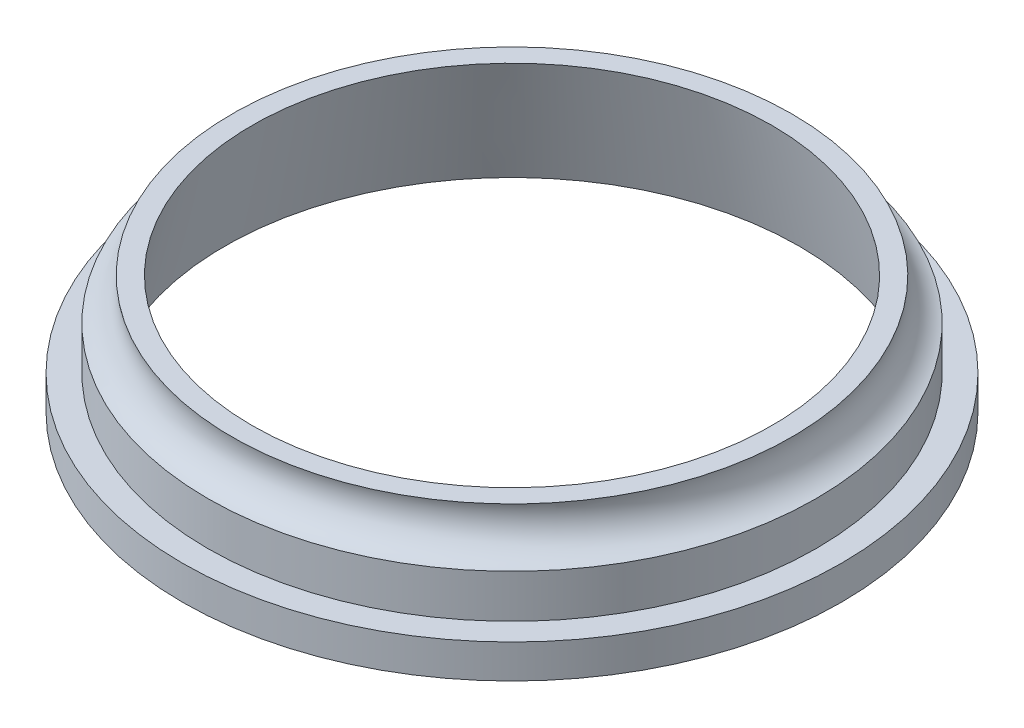
ISO-10303-21;
HEADER;
FILE_DESCRIPTION(('STEP AP214'),'2;1');
FILE_NAME('part.step','',(''),(''),'','','');
FILE_SCHEMA(('AUTOMOTIVE_DESIGN { 1 0 10303 214 1 1 1 1 }'));
ENDSEC;
DATA;
#1=APPLICATION_CONTEXT('core data for automotive mechanical design processes');
#2=APPLICATION_PROTOCOL_DEFINITION('international standard','automotive_design',2000,#1);
#3=PRODUCT_CONTEXT('',#1,'mechanical');
#4=PRODUCT('Part','Part','',(#3));
#5=PRODUCT_RELATED_PRODUCT_CATEGORY('part','',(#4));
#6=PRODUCT_DEFINITION_FORMATION('','',#4);
#7=PRODUCT_DEFINITION_CONTEXT('part definition',#1,'design');
#8=PRODUCT_DEFINITION('design','',#6,#7);
#9=PRODUCT_DEFINITION_SHAPE('','',#8);
#10=(LENGTH_UNIT() NAMED_UNIT(*) SI_UNIT(.MILLI.,.METRE.));
#11=(NAMED_UNIT(*) PLANE_ANGLE_UNIT() SI_UNIT($,.RADIAN.));
#12=(NAMED_UNIT(*) SI_UNIT($,.STERADIAN.) SOLID_ANGLE_UNIT());
#13=UNCERTAINTY_MEASURE_WITH_UNIT(LENGTH_MEASURE(1.E-05),#10,'distance_accuracy_value','');
#14=(GEOMETRIC_REPRESENTATION_CONTEXT(3) GLOBAL_UNCERTAINTY_ASSIGNED_CONTEXT((#13)) GLOBAL_UNIT_ASSIGNED_CONTEXT((#10,
#11,#12)) REPRESENTATION_CONTEXT('',''));
#15=CARTESIAN_POINT('',(0.,0.,0.));
#16=DIRECTION('',(0.,0.,1.));
#17=DIRECTION('',(1.,0.,0.));
#18=AXIS2_PLACEMENT_3D('',#15,#16,#17);
#19=CARTESIAN_POINT('',(0.,0.499999999999999,0.));
#20=DIRECTION('',(0.,-1.,0.));
#21=DIRECTION('',(0.,0.,-1.));
#22=AXIS2_PLACEMENT_3D('',#19,#20,#21);
#23=CONICAL_SURFACE('',#22,15.3839226621211,0.226892802759263);
#24=CARTESIAN_POINT('',(0.,-6.5,0.));
#25=DIRECTION('',(0.,-1.,0.));
#26=DIRECTION('',(0.,0.,-1.));
#27=AXIS2_PLACEMENT_3D('',#24,#25,#26);
#28=CIRCLE('',#27,17.);
#29=CARTESIAN_POINT('',(0.,-6.5,-17.));
#30=VERTEX_POINT('',#29);
#31=EDGE_CURVE('E10',#30,#30,#28,.T.);
#32=ORIENTED_EDGE('',*,*,#31,.T.);
#33=EDGE_LOOP('',(#32));
#34=FACE_BOUND('',#33,.T.);
#35=CARTESIAN_POINT('',(0.,0.499999999999999,0.));
#36=DIRECTION('',(0.,-1.,0.));
#37=DIRECTION('',(0.,0.,-1.));
#38=AXIS2_PLACEMENT_3D('',#35,#36,#37);
#39=CIRCLE('',#38,15.3839226621211);
#40=CARTESIAN_POINT('',(0.,0.499999999999999,-15.3839226621211));
#41=VERTEX_POINT('',#40);
#42=EDGE_CURVE('E49',#41,#41,#39,.T.);
#43=ORIENTED_EDGE('',*,*,#42,.F.);
#44=EDGE_LOOP('',(#43));
#45=FACE_BOUND('',#44,.T.);
#46=ADVANCED_FACE('F24',(#34,#45),#23,.F.);
#47=CARTESIAN_POINT('',(17.,-6.5,0.));
#48=DIRECTION('',(0.,-1.,0.));
#49=DIRECTION('',(0.,0.,-1.));
#50=AXIS2_PLACEMENT_3D('',#47,#48,#49);
#51=PLANE('',#50);
#52=CARTESIAN_POINT('',(0.,-6.5,0.));
#53=DIRECTION('',(0.,-1.,0.));
#54=DIRECTION('',(0.,0.,-1.));
#55=AXIS2_PLACEMENT_3D('',#52,#53,#54);
#56=CIRCLE('',#55,19.5);
#57=CARTESIAN_POINT('',(0.,-6.5,-19.5));
#58=VERTEX_POINT('',#57);
#59=EDGE_CURVE('E30',#58,#58,#56,.T.);
#60=ORIENTED_EDGE('',*,*,#59,.T.);
#61=EDGE_LOOP('',(#60));
#62=FACE_BOUND('',#61,.T.);
#63=ORIENTED_EDGE('',*,*,#31,.F.);
#64=EDGE_LOOP('',(#63));
#65=FACE_BOUND('',#64,.T.);
#66=ADVANCED_FACE('F57',(#62,#65),#51,.T.);
#67=CARTESIAN_POINT('',(0.,-11.2328924162258,0.));
#68=DIRECTION('',(0.,-1.,0.));
#69=DIRECTION('',(0.,0.,-1.));
#70=AXIS2_PLACEMENT_3D('',#67,#68,#69);
#71=CYLINDRICAL_SURFACE('',#70,19.5);
#72=CARTESIAN_POINT('',(0.,-4.5,0.));
#73=DIRECTION('',(0.,-1.,0.));
#74=DIRECTION('',(0.,0.,-1.));
#75=AXIS2_PLACEMENT_3D('',#72,#73,#74);
#76=CIRCLE('',#75,19.5);
#77=CARTESIAN_POINT('',(0.,-4.5,-19.5));
#78=VERTEX_POINT('',#77);
#79=EDGE_CURVE('E34',#78,#78,#76,.T.);
#80=ORIENTED_EDGE('',*,*,#79,.T.);
#81=EDGE_LOOP('',(#80));
#82=FACE_BOUND('',#81,.T.);
#83=ORIENTED_EDGE('',*,*,#59,.F.);
#84=EDGE_LOOP('',(#83));
#85=FACE_BOUND('',#84,.T.);
#86=ADVANCED_FACE('F61',(#82,#85),#71,.T.);
#87=CARTESIAN_POINT('',(19.5,-4.5,0.));
#88=DIRECTION('',(0.,1.,0.));
#89=DIRECTION('',(0.,0.,1.));
#90=AXIS2_PLACEMENT_3D('',#87,#88,#89);
#91=PLANE('',#90);
#92=CARTESIAN_POINT('',(0.,-4.5,0.));
#93=DIRECTION('',(0.,-1.,0.));
#94=DIRECTION('',(0.,0.,-1.));
#95=AXIS2_PLACEMENT_3D('',#92,#93,#94);
#96=CIRCLE('',#95,18.);
#97=CARTESIAN_POINT('',(0.,-4.5,-18.));
#98=VERTEX_POINT('',#97);
#99=EDGE_CURVE('E38',#98,#98,#96,.T.);
#100=ORIENTED_EDGE('',*,*,#99,.T.);
#101=EDGE_LOOP('',(#100));
#102=FACE_BOUND('',#101,.T.);
#103=ORIENTED_EDGE('',*,*,#79,.F.);
#104=EDGE_LOOP('',(#103));
#105=FACE_BOUND('',#104,.T.);
#106=ADVANCED_FACE('F65',(#102,#105),#91,.T.);
#107=CARTESIAN_POINT('',(0.,-11.2328924162258,0.));
#108=DIRECTION('',(0.,-1.,0.));
#109=DIRECTION('',(0.,0.,-1.));
#110=AXIS2_PLACEMENT_3D('',#107,#108,#109);
#111=CYLINDRICAL_SURFACE('',#110,18.);
#112=CARTESIAN_POINT('',(0.,-1.93649167310371,0.));
#113=DIRECTION('',(0.,-1.,0.));
#114=DIRECTION('',(0.,0.,-1.));
#115=AXIS2_PLACEMENT_3D('',#112,#113,#114);
#116=CIRCLE('',#115,18.);
#117=CARTESIAN_POINT('',(0.,-1.93649167310371,-18.));
#118=VERTEX_POINT('',#117);
#119=EDGE_CURVE('E43',#118,#118,#116,.T.);
#120=ORIENTED_EDGE('',*,*,#119,.T.);
#121=EDGE_LOOP('',(#120));
#122=FACE_BOUND('',#121,.T.);
#123=ORIENTED_EDGE('',*,*,#99,.F.);
#124=EDGE_LOOP('',(#123));
#125=FACE_BOUND('',#124,.T.);
#126=ADVANCED_FACE('F72',(#122,#125),#111,.T.);
#127=CARTESIAN_POINT('',(0.,0.,0.));
#128=DIRECTION('',(0.,-1.,0.));
#129=DIRECTION('',(0.,0.,-1.));
#130=AXIS2_PLACEMENT_3D('',#127,#128,#129);
#131=TOROIDAL_SURFACE('',#130,18.5,2.);
#132=CARTESIAN_POINT('',(0.,0.499999999999999,0.));
#133=DIRECTION('',(0.,-1.,0.));
#134=DIRECTION('',(0.,0.,-1.));
#135=AXIS2_PLACEMENT_3D('',#132,#133,#134);
#136=CIRCLE('',#135,16.5635083268963);
#137=CARTESIAN_POINT('',(0.,0.499999999999999,-16.5635083268963));
#138=VERTEX_POINT('',#137);
#139=EDGE_CURVE('E46',#138,#138,#136,.T.);
#140=ORIENTED_EDGE('',*,*,#139,.T.);
#141=EDGE_LOOP('',(#140));
#142=FACE_BOUND('',#141,.T.);
#143=ORIENTED_EDGE('',*,*,#119,.F.);
#144=EDGE_LOOP('',(#143));
#145=FACE_BOUND('',#144,.T.);
#146=ADVANCED_FACE('F76',(#142,#145),#131,.F.);
#147=CARTESIAN_POINT('',(15.3839226621211,0.499999999999999,0.));
#148=DIRECTION('',(0.,1.,0.));
#149=DIRECTION('',(0.,0.,1.));
#150=AXIS2_PLACEMENT_3D('',#147,#148,#149);
#151=PLANE('',#150);
#152=ORIENTED_EDGE('',*,*,#42,.T.);
#153=EDGE_LOOP('',(#152));
#154=FACE_BOUND('',#153,.T.);
#155=ORIENTED_EDGE('',*,*,#139,.F.);
#156=EDGE_LOOP('',(#155));
#157=FACE_BOUND('',#156,.T.);
#158=ADVANCED_FACE('F53',(#154,#157),#151,.T.);
#159=CLOSED_SHELL('',(#46,#66,#86,#106,#126,#146,#158));
#160=MANIFOLD_SOLID_BREP('B2',#159);
#161=ADVANCED_BREP_SHAPE_REPRESENTATION('',(#18,#160),#14);
#162=SHAPE_DEFINITION_REPRESENTATION(#9,#161);
ENDSEC;
END-ISO-10303-21;
